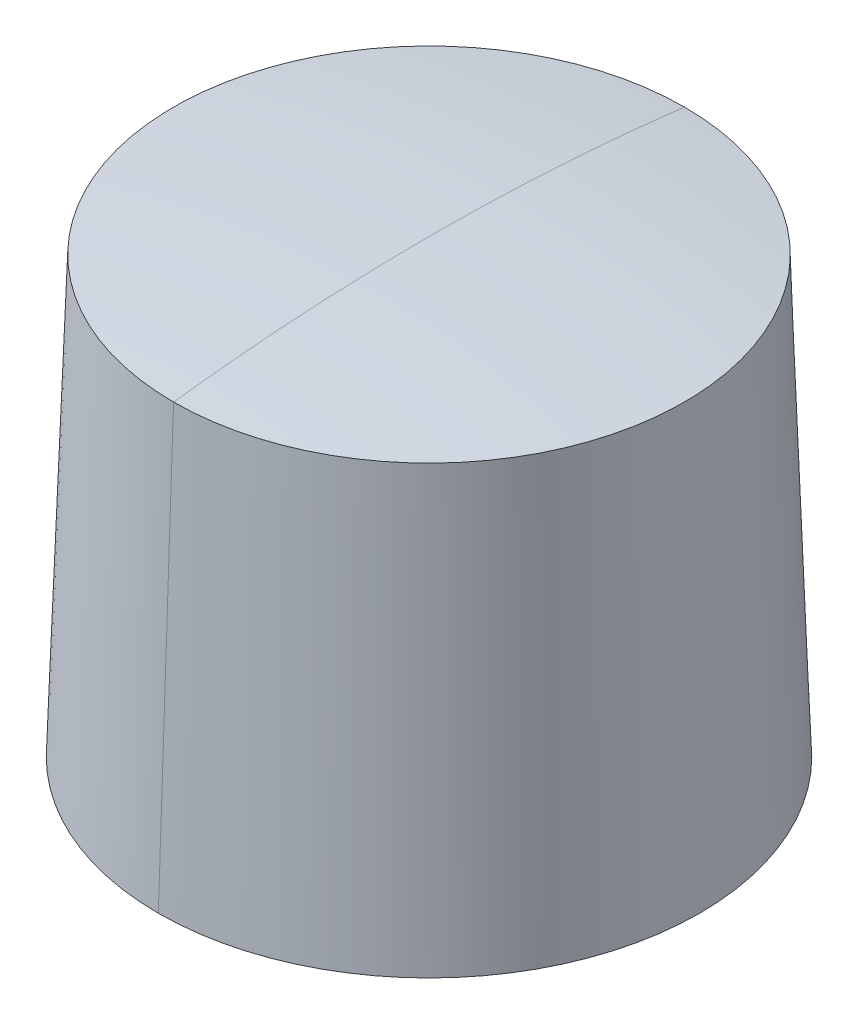
ISO-10303-21;
HEADER;
FILE_DESCRIPTION(('STEP AP214'),'2;1');
FILE_NAME('part.step','',(''),(''),'','','');
FILE_SCHEMA(('AUTOMOTIVE_DESIGN { 1 0 10303 214 1 1 1 1 }'));
ENDSEC;
DATA;
#1=APPLICATION_CONTEXT('core data for automotive mechanical design processes');
#2=APPLICATION_PROTOCOL_DEFINITION('international standard','automotive_design',2000,#1);
#3=PRODUCT_CONTEXT('',#1,'mechanical');
#4=PRODUCT('Part','Part','',(#3));
#5=PRODUCT_RELATED_PRODUCT_CATEGORY('part','',(#4));
#6=PRODUCT_DEFINITION_FORMATION('','',#4);
#7=PRODUCT_DEFINITION_CONTEXT('part definition',#1,'design');
#8=PRODUCT_DEFINITION('design','',#6,#7);
#9=PRODUCT_DEFINITION_SHAPE('','',#8);
#10=(LENGTH_UNIT() NAMED_UNIT(*) SI_UNIT(.MILLI.,.METRE.));
#11=(NAMED_UNIT(*) PLANE_ANGLE_UNIT() SI_UNIT($,.RADIAN.));
#12=(NAMED_UNIT(*) SI_UNIT($,.STERADIAN.) SOLID_ANGLE_UNIT());
#13=UNCERTAINTY_MEASURE_WITH_UNIT(LENGTH_MEASURE(1.E-05),#10,'distance_accuracy_value','');
#14=(GEOMETRIC_REPRESENTATION_CONTEXT(3) GLOBAL_UNCERTAINTY_ASSIGNED_CONTEXT((#13)) GLOBAL_UNIT_ASSIGNED_CONTEXT((#10,
#11,#12)) REPRESENTATION_CONTEXT('',''));
#15=CARTESIAN_POINT('',(0.,0.,0.));
#16=DIRECTION('',(0.,0.,1.));
#17=DIRECTION('',(1.,0.,0.));
#18=AXIS2_PLACEMENT_3D('',#15,#16,#17);
#19=CARTESIAN_POINT('',(0.,-40.1808446209665,5.10680907284122E-12));
#20=DIRECTION('',(0.,-1.,0.));
#21=DIRECTION('',(1.,0.,0.));
#22=AXIS2_PLACEMENT_3D('',#19,#20,#21);
#23=SPHERICAL_SURFACE('',#22,51.1790446209665);
#24=CARTESIAN_POINT('',(0.,-40.1808446209665,5.10680907284122E-12));
#25=DIRECTION('',(1.,0.,0.));
#26=DIRECTION('',(0.,0.992555546848877,-0.121792801181047));
#27=AXIS2_PLACEMENT_3D('',#24,#25,#26);
#28=CIRCLE('',#27,51.1790446209665);
#29=CARTESIAN_POINT('',(0.,10.6172,-6.23323920615221));
#30=VERTEX_POINT('',#29);
#31=CARTESIAN_POINT('',(0.,10.9982,5.1036752601823E-12));
#32=VERTEX_POINT('',#31);
#33=EDGE_CURVE('E11',#30,#32,#28,.T.);
#34=ORIENTED_EDGE('',*,*,#33,.F.);
#35=CARTESIAN_POINT('',(0.,10.6172,0.));
#36=DIRECTION('',(0.,-1.,0.));
#37=DIRECTION('',(0.,0.,-1.));
#38=AXIS2_PLACEMENT_3D('',#35,#36,#37);
#39=CIRCLE('',#38,6.23323920615221);
#40=CARTESIAN_POINT('',(0.,10.6172,6.23323920616242));
#41=VERTEX_POINT('',#40);
#42=EDGE_CURVE('E25',#41,#30,#39,.T.);
#43=ORIENTED_EDGE('',*,*,#42,.F.);
#44=CARTESIAN_POINT('',(0.,-40.1808446209665,5.10680907284122E-12));
#45=DIRECTION('',(-1.,0.,0.));
#46=DIRECTION('',(0.,0.992555546848877,0.121792801181047));
#47=AXIS2_PLACEMENT_3D('',#44,#45,#46);
#48=CIRCLE('',#47,51.1790446209665);
#49=EDGE_CURVE('E73',#41,#32,#48,.T.);
#50=ORIENTED_EDGE('',*,*,#49,.T.);
#51=EDGE_LOOP('',(#34,#43,#50));
#52=FACE_BOUND('',#51,.T.);
#53=ADVANCED_FACE('F17',(#52),#23,.T.);
#54=CARTESIAN_POINT('',(0.,-40.1808446209665,5.10680907284122E-12));
#55=DIRECTION('',(0.,-1.,0.));
#56=DIRECTION('',(-1.,0.,0.));
#57=AXIS2_PLACEMENT_3D('',#54,#55,#56);
#58=SPHERICAL_SURFACE('',#57,51.1790446209665);
#59=ORIENTED_EDGE('',*,*,#49,.F.);
#60=CARTESIAN_POINT('',(0.,10.6172,0.));
#61=DIRECTION('',(0.,-1.,0.));
#62=DIRECTION('',(0.,0.,-1.));
#63=AXIS2_PLACEMENT_3D('',#60,#61,#62);
#64=CIRCLE('',#63,6.23323920615221);
#65=EDGE_CURVE('E69',#30,#41,#64,.T.);
#66=ORIENTED_EDGE('',*,*,#65,.F.);
#67=ORIENTED_EDGE('',*,*,#33,.T.);
#68=EDGE_LOOP('',(#59,#66,#67));
#69=FACE_BOUND('',#68,.T.);
#70=ADVANCED_FACE('F83',(#69),#58,.T.);
#71=CARTESIAN_POINT('',(0.,10.6172,0.));
#72=DIRECTION('',(0.,-1.,0.));
#73=DIRECTION('',(-1.,0.,0.));
#74=AXIS2_PLACEMENT_3D('',#71,#72,#73);
#75=CONICAL_SURFACE('',#74,6.23323920615221,0.0349065850398871);
#76=DIRECTION('',(0.,-0.999390827019096,0.0348994967025015));
#77=VECTOR('',#76,1.);
#78=CARTESIAN_POINT('',(0.,10.6172,6.23323920615221));
#79=LINE('',#78,#77);
#80=CARTESIAN_POINT('',(0.,0.,6.604));
#81=VERTEX_POINT('',#80);
#82=EDGE_CURVE('E50',#41,#81,#79,.T.);
#83=ORIENTED_EDGE('',*,*,#82,.T.);
#84=CARTESIAN_POINT('',(0.,0.,0.));
#85=DIRECTION('',(0.,-1.,0.));
#86=DIRECTION('',(0.,0.,-1.));
#87=AXIS2_PLACEMENT_3D('',#84,#85,#86);
#88=CIRCLE('',#87,6.604);
#89=CARTESIAN_POINT('',(0.,0.,-6.604));
#90=VERTEX_POINT('',#89);
#91=EDGE_CURVE('E45',#90,#81,#88,.T.);
#92=ORIENTED_EDGE('',*,*,#91,.F.);
#93=DIRECTION('',(0.,-0.999390827019096,-0.0348994967025015));
#94=VECTOR('',#93,1.);
#95=CARTESIAN_POINT('',(0.,10.6172,-6.23323920615221));
#96=LINE('',#95,#94);
#97=EDGE_CURVE('E48',#30,#90,#96,.T.);
#98=ORIENTED_EDGE('',*,*,#97,.F.);
#99=ORIENTED_EDGE('',*,*,#65,.T.);
#100=EDGE_LOOP('',(#83,#92,#98,#99));
#101=FACE_BOUND('',#100,.T.);
#102=ADVANCED_FACE('F47',(#101),#75,.T.);
#103=CARTESIAN_POINT('',(0.,10.6172,0.));
#104=DIRECTION('',(0.,-1.,0.));
#105=DIRECTION('',(1.,0.,0.));
#106=AXIS2_PLACEMENT_3D('',#103,#104,#105);
#107=CONICAL_SURFACE('',#106,6.23323920615221,0.0349065850398871);
#108=ORIENTED_EDGE('',*,*,#82,.F.);
#109=ORIENTED_EDGE('',*,*,#42,.T.);
#110=ORIENTED_EDGE('',*,*,#97,.T.);
#111=CARTESIAN_POINT('',(0.,0.,0.));
#112=DIRECTION('',(0.,-1.,0.));
#113=DIRECTION('',(0.,0.,-1.));
#114=AXIS2_PLACEMENT_3D('',#111,#112,#113);
#115=CIRCLE('',#114,6.604);
#116=EDGE_CURVE('E57',#81,#90,#115,.T.);
#117=ORIENTED_EDGE('',*,*,#116,.F.);
#118=EDGE_LOOP('',(#108,#109,#110,#117));
#119=FACE_BOUND('',#118,.T.);
#120=ADVANCED_FACE('F56',(#119),#107,.T.);
#121=CARTESIAN_POINT('',(0.,0.,-6.604));
#122=DIRECTION('',(0.,1.,0.));
#123=DIRECTION('',(0.,0.,1.));
#124=AXIS2_PLACEMENT_3D('',#121,#122,#123);
#125=PLANE('',#124);
#126=ORIENTED_EDGE('',*,*,#91,.T.);
#127=ORIENTED_EDGE('',*,*,#116,.T.);
#128=EDGE_LOOP('',(#126,#127));
#129=FACE_BOUND('',#128,.T.);
#130=ADVANCED_FACE('F59',(#129),#125,.F.);
#131=CLOSED_SHELL('',(#53,#70,#102,#120,#130));
#132=MANIFOLD_SOLID_BREP('B1',#131);
#133=ADVANCED_BREP_SHAPE_REPRESENTATION('',(#18,#132),#14);
#134=SHAPE_DEFINITION_REPRESENTATION(#9,#133);
ENDSEC;
END-ISO-10303-21;
